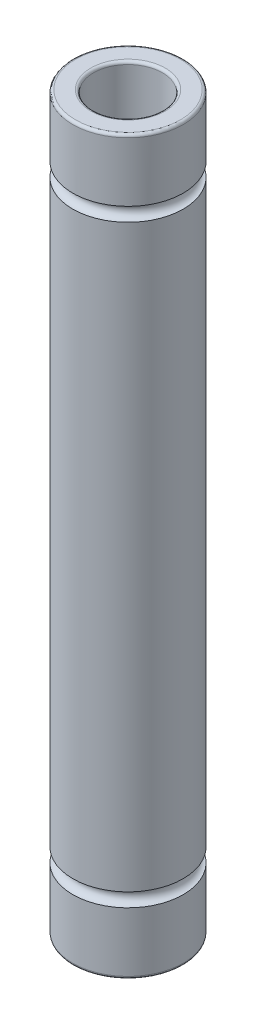
ISO-10303-21;
HEADER;
FILE_DESCRIPTION(('STEP AP214'),'2;1');
FILE_NAME('part.step','',(''),(''),'','','');
FILE_SCHEMA(('AUTOMOTIVE_DESIGN { 1 0 10303 214 1 1 1 1 }'));
ENDSEC;
DATA;
#1=APPLICATION_CONTEXT('core data for automotive mechanical design processes');
#2=APPLICATION_PROTOCOL_DEFINITION('international standard','automotive_design',2000,#1);
#3=PRODUCT_CONTEXT('',#1,'mechanical');
#4=PRODUCT('Part','Part','',(#3));
#5=PRODUCT_RELATED_PRODUCT_CATEGORY('part','',(#4));
#6=PRODUCT_DEFINITION_FORMATION('','',#4);
#7=PRODUCT_DEFINITION_CONTEXT('part definition',#1,'design');
#8=PRODUCT_DEFINITION('design','',#6,#7);
#9=PRODUCT_DEFINITION_SHAPE('','',#8);
#10=(LENGTH_UNIT() NAMED_UNIT(*) SI_UNIT(.MILLI.,.METRE.));
#11=(NAMED_UNIT(*) PLANE_ANGLE_UNIT() SI_UNIT($,.RADIAN.));
#12=(NAMED_UNIT(*) SI_UNIT($,.STERADIAN.) SOLID_ANGLE_UNIT());
#13=UNCERTAINTY_MEASURE_WITH_UNIT(LENGTH_MEASURE(1.E-05),#10,'distance_accuracy_value','');
#14=(GEOMETRIC_REPRESENTATION_CONTEXT(3) GLOBAL_UNCERTAINTY_ASSIGNED_CONTEXT((#13)) GLOBAL_UNIT_ASSIGNED_CONTEXT((#10,
#11,#12)) REPRESENTATION_CONTEXT('',''));
#15=CARTESIAN_POINT('',(0.,0.,0.));
#16=DIRECTION('',(0.,0.,1.));
#17=DIRECTION('',(1.,0.,0.));
#18=AXIS2_PLACEMENT_3D('',#15,#16,#17);
#19=CARTESIAN_POINT('',(0.,26.5,0.));
#20=DIRECTION('',(0.,-1.,0.));
#21=DIRECTION('',(0.,0.,-1.));
#22=AXIS2_PLACEMENT_3D('',#19,#20,#21);
#23=CYLINDRICAL_SURFACE('',#22,4.);
#24=CARTESIAN_POINT('',(0.,-21.,0.));
#25=DIRECTION('',(0.,-1.,0.));
#26=DIRECTION('',(0.,0.,-1.));
#27=AXIS2_PLACEMENT_3D('',#24,#25,#26);
#28=CIRCLE('',#27,4.);
#29=CARTESIAN_POINT('',(0.,-21.,-4.));
#30=VERTEX_POINT('',#29);
#31=EDGE_CURVE('E69',#30,#30,#28,.T.);
#32=ORIENTED_EDGE('',*,*,#31,.F.);
#33=EDGE_LOOP('',(#32));
#34=FACE_BOUND('',#33,.T.);
#35=CARTESIAN_POINT('',(0.,21.,0.));
#36=DIRECTION('',(0.,1.,0.));
#37=DIRECTION('',(0.,0.,1.));
#38=AXIS2_PLACEMENT_3D('',#35,#36,#37);
#39=CIRCLE('',#38,4.);
#40=CARTESIAN_POINT('',(0.,21.,4.));
#41=VERTEX_POINT('',#40);
#42=EDGE_CURVE('E70',#41,#41,#39,.T.);
#43=ORIENTED_EDGE('',*,*,#42,.F.);
#44=EDGE_LOOP('',(#43));
#45=FACE_BOUND('',#44,.T.);
#46=ADVANCED_FACE('F37',(#34,#45),#23,.T.);
#47=CARTESIAN_POINT('',(0.,26.3,0.));
#48=DIRECTION('',(0.,1.,0.));
#49=DIRECTION('',(0.,0.,1.));
#50=AXIS2_PLACEMENT_3D('',#47,#48,#49);
#51=CIRCLE('',#50,4.);
#52=CARTESIAN_POINT('',(0.,26.3,4.));
#53=VERTEX_POINT('',#52);
#54=EDGE_CURVE('E60',#53,#53,#51,.F.);
#55=ORIENTED_EDGE('',*,*,#54,.T.);
#56=EDGE_LOOP('',(#55));
#57=FACE_BOUND('',#56,.T.);
#58=CARTESIAN_POINT('',(0.,22.,0.));
#59=DIRECTION('',(0.,-1.,0.));
#60=DIRECTION('',(0.,0.,-1.));
#61=AXIS2_PLACEMENT_3D('',#58,#59,#60);
#62=CIRCLE('',#61,4.);
#63=CARTESIAN_POINT('',(0.,22.,-4.));
#64=VERTEX_POINT('',#63);
#65=EDGE_CURVE('E74',#64,#64,#62,.T.);
#66=ORIENTED_EDGE('',*,*,#65,.F.);
#67=EDGE_LOOP('',(#66));
#68=FACE_BOUND('',#67,.T.);
#69=ADVANCED_FACE('F88',(#57,#68),#23,.T.);
#70=CARTESIAN_POINT('',(0.,-26.3,0.));
#71=DIRECTION('',(0.,1.,0.));
#72=DIRECTION('',(0.,0.,1.));
#73=AXIS2_PLACEMENT_3D('',#70,#71,#72);
#74=CIRCLE('',#73,4.);
#75=CARTESIAN_POINT('',(0.,-26.3,4.));
#76=VERTEX_POINT('',#75);
#77=EDGE_CURVE('E10',#76,#76,#74,.T.);
#78=ORIENTED_EDGE('',*,*,#77,.T.);
#79=EDGE_LOOP('',(#78));
#80=FACE_BOUND('',#79,.T.);
#81=CARTESIAN_POINT('',(0.,-22.,0.));
#82=DIRECTION('',(0.,1.,0.));
#83=DIRECTION('',(0.,0.,1.));
#84=AXIS2_PLACEMENT_3D('',#81,#82,#83);
#85=CIRCLE('',#84,4.);
#86=CARTESIAN_POINT('',(0.,-22.,4.));
#87=VERTEX_POINT('',#86);
#88=EDGE_CURVE('E73',#87,#87,#85,.T.);
#89=ORIENTED_EDGE('',*,*,#88,.F.);
#90=EDGE_LOOP('',(#89));
#91=FACE_BOUND('',#90,.T.);
#92=ADVANCED_FACE('F85',(#80,#91),#23,.T.);
#93=CARTESIAN_POINT('',(0.,26.5,0.));
#94=DIRECTION('',(0.,1.,0.));
#95=DIRECTION('',(0.,0.,1.));
#96=AXIS2_PLACEMENT_3D('',#93,#94,#95);
#97=PLANE('',#96);
#98=CARTESIAN_POINT('',(0.,26.5,0.));
#99=DIRECTION('',(0.,1.,0.));
#100=DIRECTION('',(0.,0.,1.));
#101=AXIS2_PLACEMENT_3D('',#98,#99,#100);
#102=CIRCLE('',#101,3.8);
#103=CARTESIAN_POINT('',(0.,26.5,3.8));
#104=VERTEX_POINT('',#103);
#105=EDGE_CURVE('E63',#104,#104,#102,.T.);
#106=ORIENTED_EDGE('',*,*,#105,.T.);
#107=EDGE_LOOP('',(#106));
#108=FACE_BOUND('',#107,.T.);
#109=CARTESIAN_POINT('',(0.,26.5,0.));
#110=DIRECTION('',(0.,1.,0.));
#111=DIRECTION('',(0.,0.,1.));
#112=AXIS2_PLACEMENT_3D('',#109,#110,#111);
#113=CIRCLE('',#112,2.7);
#114=CARTESIAN_POINT('',(0.,26.5,2.7));
#115=VERTEX_POINT('',#114);
#116=EDGE_CURVE('E66',#115,#115,#113,.F.);
#117=ORIENTED_EDGE('',*,*,#116,.T.);
#118=EDGE_LOOP('',(#117));
#119=FACE_BOUND('',#118,.T.);
#120=ADVANCED_FACE('F87',(#108,#119),#97,.T.);
#121=CARTESIAN_POINT('',(0.,-26.5,0.));
#122=DIRECTION('',(0.,1.,0.));
#123=DIRECTION('',(0.,0.,1.));
#124=AXIS2_PLACEMENT_3D('',#121,#122,#123);
#125=PLANE('',#124);
#126=CARTESIAN_POINT('',(0.,-26.5,0.));
#127=DIRECTION('',(0.,1.,0.));
#128=DIRECTION('',(0.,0.,1.));
#129=AXIS2_PLACEMENT_3D('',#126,#127,#128);
#130=CIRCLE('',#129,2.7);
#131=CARTESIAN_POINT('',(0.,-26.5,2.7));
#132=VERTEX_POINT('',#131);
#133=EDGE_CURVE('E44',#132,#132,#130,.T.);
#134=ORIENTED_EDGE('',*,*,#133,.T.);
#135=EDGE_LOOP('',(#134));
#136=FACE_BOUND('',#135,.T.);
#137=CARTESIAN_POINT('',(0.,-26.5,0.));
#138=DIRECTION('',(0.,1.,0.));
#139=DIRECTION('',(0.,0.,1.));
#140=AXIS2_PLACEMENT_3D('',#137,#138,#139);
#141=CIRCLE('',#140,3.8);
#142=CARTESIAN_POINT('',(0.,-26.5,3.8));
#143=VERTEX_POINT('',#142);
#144=EDGE_CURVE('E48',#143,#143,#141,.F.);
#145=ORIENTED_EDGE('',*,*,#144,.T.);
#146=EDGE_LOOP('',(#145));
#147=FACE_BOUND('',#146,.T.);
#148=ADVANCED_FACE('F94',(#136,#147),#125,.F.);
#149=CARTESIAN_POINT('',(0.,26.5,0.));
#150=DIRECTION('',(0.,-1.,0.));
#151=DIRECTION('',(0.,0.,-1.));
#152=AXIS2_PLACEMENT_3D('',#149,#150,#151);
#153=CYLINDRICAL_SURFACE('',#152,2.5);
#154=CARTESIAN_POINT('',(0.,26.3,0.));
#155=DIRECTION('',(0.,1.,0.));
#156=DIRECTION('',(0.,0.,1.));
#157=AXIS2_PLACEMENT_3D('',#154,#155,#156);
#158=CIRCLE('',#157,2.5);
#159=CARTESIAN_POINT('',(0.,26.3,2.5));
#160=VERTEX_POINT('',#159);
#161=EDGE_CURVE('E52',#160,#160,#158,.T.);
#162=ORIENTED_EDGE('',*,*,#161,.T.);
#163=EDGE_LOOP('',(#162));
#164=FACE_BOUND('',#163,.T.);
#165=CARTESIAN_POINT('',(0.,-26.3,0.));
#166=DIRECTION('',(0.,1.,0.));
#167=DIRECTION('',(0.,0.,1.));
#168=AXIS2_PLACEMENT_3D('',#165,#166,#167);
#169=CIRCLE('',#168,2.5);
#170=CARTESIAN_POINT('',(0.,-26.3,2.5));
#171=VERTEX_POINT('',#170);
#172=EDGE_CURVE('E57',#171,#171,#169,.F.);
#173=ORIENTED_EDGE('',*,*,#172,.T.);
#174=EDGE_LOOP('',(#173));
#175=FACE_BOUND('',#174,.T.);
#176=ADVANCED_FACE('F119',(#164,#175),#153,.F.);
#177=CARTESIAN_POINT('',(0.,-21.5,0.));
#178=DIRECTION('',(0.,1.,0.));
#179=DIRECTION('',(0.,0.,1.));
#180=AXIS2_PLACEMENT_3D('',#177,#178,#179);
#181=TOROIDAL_SURFACE('',#180,4.,0.500000000000001);
#182=ORIENTED_EDGE('',*,*,#88,.T.);
#183=EDGE_LOOP('',(#182));
#184=FACE_BOUND('',#183,.T.);
#185=ORIENTED_EDGE('',*,*,#31,.T.);
#186=EDGE_LOOP('',(#185));
#187=FACE_BOUND('',#186,.T.);
#188=ADVANCED_FACE('F82',(#184,#187),#181,.F.);
#189=CARTESIAN_POINT('',(0.,21.5,0.));
#190=DIRECTION('',(0.,-1.,0.));
#191=DIRECTION('',(0.,0.,1.));
#192=AXIS2_PLACEMENT_3D('',#189,#190,#191);
#193=TOROIDAL_SURFACE('',#192,4.,0.500000000000001);
#194=ORIENTED_EDGE('',*,*,#65,.T.);
#195=EDGE_LOOP('',(#194));
#196=FACE_BOUND('',#195,.T.);
#197=ORIENTED_EDGE('',*,*,#42,.T.);
#198=EDGE_LOOP('',(#197));
#199=FACE_BOUND('',#198,.T.);
#200=ADVANCED_FACE('F108',(#196,#199),#193,.F.);
#201=CARTESIAN_POINT('',(0.,26.3,0.));
#202=DIRECTION('',(0.,1.,0.));
#203=DIRECTION('',(0.,0.,1.));
#204=AXIS2_PLACEMENT_3D('',#201,#202,#203);
#205=TOROIDAL_SURFACE('',#204,3.8,0.2);
#206=ORIENTED_EDGE('',*,*,#54,.F.);
#207=EDGE_LOOP('',(#206));
#208=FACE_BOUND('',#207,.T.);
#209=ORIENTED_EDGE('',*,*,#105,.F.);
#210=EDGE_LOOP('',(#209));
#211=FACE_BOUND('',#210,.T.);
#212=ADVANCED_FACE('F110',(#208,#211),#205,.T.);
#213=CARTESIAN_POINT('',(0.,26.3,0.));
#214=DIRECTION('',(0.,1.,0.));
#215=DIRECTION('',(0.,0.,1.));
#216=AXIS2_PLACEMENT_3D('',#213,#214,#215);
#217=TOROIDAL_SURFACE('',#216,2.7,0.2);
#218=ORIENTED_EDGE('',*,*,#116,.F.);
#219=EDGE_LOOP('',(#218));
#220=FACE_BOUND('',#219,.T.);
#221=ORIENTED_EDGE('',*,*,#161,.F.);
#222=EDGE_LOOP('',(#221));
#223=FACE_BOUND('',#222,.T.);
#224=ADVANCED_FACE('F117',(#220,#223),#217,.T.);
#225=CARTESIAN_POINT('',(0.,-26.3,0.));
#226=DIRECTION('',(0.,1.,0.));
#227=DIRECTION('',(0.,0.,1.));
#228=AXIS2_PLACEMENT_3D('',#225,#226,#227);
#229=TOROIDAL_SURFACE('',#228,2.7,0.2);
#230=ORIENTED_EDGE('',*,*,#172,.F.);
#231=EDGE_LOOP('',(#230));
#232=FACE_BOUND('',#231,.T.);
#233=ORIENTED_EDGE('',*,*,#133,.F.);
#234=EDGE_LOOP('',(#233));
#235=FACE_BOUND('',#234,.T.);
#236=ADVANCED_FACE('F132',(#232,#235),#229,.T.);
#237=CARTESIAN_POINT('',(0.,-26.3,0.));
#238=DIRECTION('',(0.,1.,0.));
#239=DIRECTION('',(0.,0.,1.));
#240=AXIS2_PLACEMENT_3D('',#237,#238,#239);
#241=TOROIDAL_SURFACE('',#240,3.8,0.2);
#242=ORIENTED_EDGE('',*,*,#144,.F.);
#243=EDGE_LOOP('',(#242));
#244=FACE_BOUND('',#243,.T.);
#245=ORIENTED_EDGE('',*,*,#77,.F.);
#246=EDGE_LOOP('',(#245));
#247=FACE_BOUND('',#246,.T.);
#248=ADVANCED_FACE('F39',(#244,#247),#241,.T.);
#249=CLOSED_SHELL('',(#46,#69,#92,#120,#148,#176,#188,#200,#212,#224,#236,#248));
#250=MANIFOLD_SOLID_BREP('B2',#249);
#251=ADVANCED_BREP_SHAPE_REPRESENTATION('',(#18,#250),#14);
#252=SHAPE_DEFINITION_REPRESENTATION(#9,#251);
ENDSEC;
END-ISO-10303-21;
